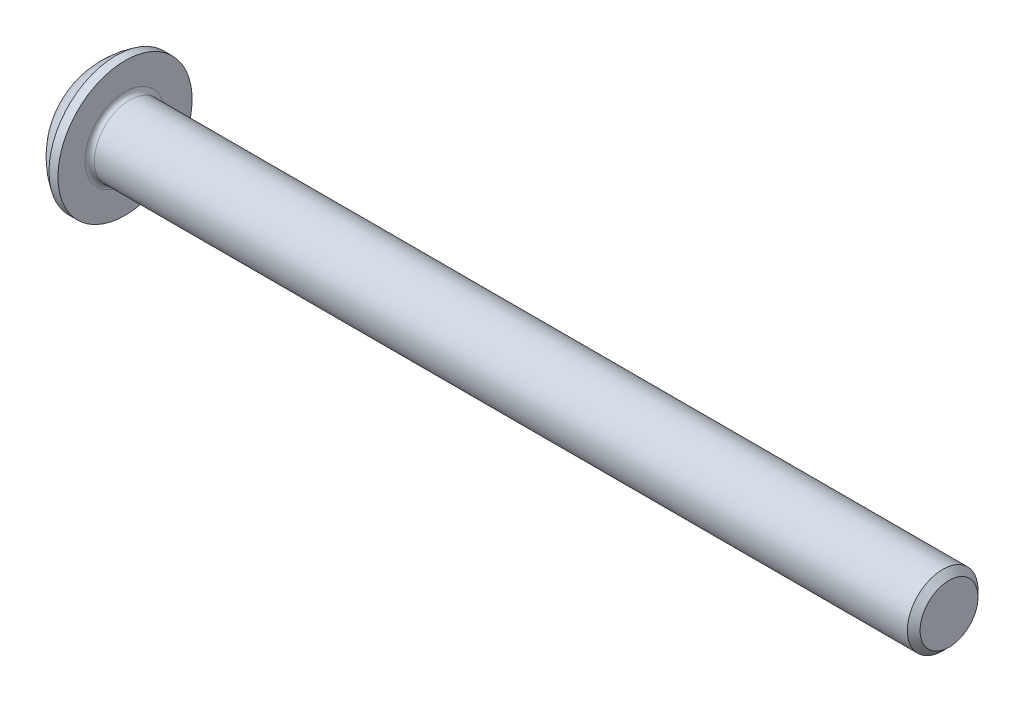
ISO-10303-21;
HEADER;
FILE_DESCRIPTION(('STEP AP214'),'2;1');
FILE_NAME('part.step','',(''),(''),'','','');
FILE_SCHEMA(('AUTOMOTIVE_DESIGN { 1 0 10303 214 1 1 1 1 }'));
ENDSEC;
DATA;
#1=APPLICATION_CONTEXT('core data for automotive mechanical design processes');
#2=APPLICATION_PROTOCOL_DEFINITION('international standard','automotive_design',2000,#1);
#3=PRODUCT_CONTEXT('',#1,'mechanical');
#4=PRODUCT('Part','Part','',(#3));
#5=PRODUCT_RELATED_PRODUCT_CATEGORY('part','',(#4));
#6=PRODUCT_DEFINITION_FORMATION('','',#4);
#7=PRODUCT_DEFINITION_CONTEXT('part definition',#1,'design');
#8=PRODUCT_DEFINITION('design','',#6,#7);
#9=PRODUCT_DEFINITION_SHAPE('','',#8);
#10=(LENGTH_UNIT() NAMED_UNIT(*) SI_UNIT(.MILLI.,.METRE.));
#11=(NAMED_UNIT(*) PLANE_ANGLE_UNIT() SI_UNIT($,.RADIAN.));
#12=(NAMED_UNIT(*) SI_UNIT($,.STERADIAN.) SOLID_ANGLE_UNIT());
#13=UNCERTAINTY_MEASURE_WITH_UNIT(LENGTH_MEASURE(1.E-05),#10,'distance_accuracy_value','');
#14=(GEOMETRIC_REPRESENTATION_CONTEXT(3) GLOBAL_UNCERTAINTY_ASSIGNED_CONTEXT((#13)) GLOBAL_UNIT_ASSIGNED_CONTEXT((#10,
#11,#12)) REPRESENTATION_CONTEXT('',''));
#15=CARTESIAN_POINT('',(0.,0.,0.));
#16=DIRECTION('',(0.,0.,1.));
#17=DIRECTION('',(1.,0.,0.));
#18=AXIS2_PLACEMENT_3D('',#15,#16,#17);
#19=CARTESIAN_POINT('',(0.,0.,0.));
#20=DIRECTION('',(-1.,0.,0.));
#21=DIRECTION('',(0.,0.,1.));
#22=AXIS2_PLACEMENT_3D('',#19,#20,#21);
#23=PLANE('',#22);
#24=CARTESIAN_POINT('',(0.,0.,0.));
#25=DIRECTION('',(-1.,0.,0.));
#26=DIRECTION('',(0.,0.,1.));
#27=AXIS2_PLACEMENT_3D('',#24,#25,#26);
#28=CIRCLE('',#27,1.425);
#29=CARTESIAN_POINT('',(0.,-1.42463005931565,0.0324683552754317));
#30=VERTEX_POINT('',#29);
#31=CARTESIAN_POINT('',(0.,-0.740433450145447,1.21753164472457));
#32=VERTEX_POINT('',#31);
#33=EDGE_CURVE('E201',#30,#32,#28,.T.);
#34=ORIENTED_EDGE('',*,*,#33,.T.);
#35=DIRECTION('',(0.,-0.5,-0.866025403784439));
#36=VECTOR('',#35,1.);
#37=CARTESIAN_POINT('',(0.,-1.44337567297406,0.));
#38=LINE('',#37,#36);
#39=EDGE_CURVE('E224',#32,#30,#38,.T.);
#40=ORIENTED_EDGE('',*,*,#39,.T.);
#41=EDGE_LOOP('',(#34,#40));
#42=FACE_BOUND('',#41,.T.);
#43=ADVANCED_FACE('F17',(#42),#23,.T.);
#44=CARTESIAN_POINT('',(0.,-0.740433450145447,-1.21753164472457));
#45=VERTEX_POINT('',#44);
#46=CARTESIAN_POINT('',(0.,-1.42463005931565,-0.0324683552754317));
#47=VERTEX_POINT('',#46);
#48=EDGE_CURVE('E215',#45,#47,#28,.T.);
#49=ORIENTED_EDGE('',*,*,#48,.T.);
#50=DIRECTION('',(0.,0.5,-0.866025403784439));
#51=VECTOR('',#50,1.);
#52=CARTESIAN_POINT('',(0.,-0.721687836487032,-1.25));
#53=LINE('',#52,#51);
#54=EDGE_CURVE('E267',#47,#45,#53,.T.);
#55=ORIENTED_EDGE('',*,*,#54,.T.);
#56=EDGE_LOOP('',(#49,#55));
#57=FACE_BOUND('',#56,.T.);
#58=ADVANCED_FACE('F309',(#57),#23,.T.);
#59=CARTESIAN_POINT('',(0.,0.684196609170199,-1.25));
#60=VERTEX_POINT('',#59);
#61=CARTESIAN_POINT('',(0.,-0.6841966091702,-1.25));
#62=VERTEX_POINT('',#61);
#63=EDGE_CURVE('E211',#60,#62,#28,.T.);
#64=ORIENTED_EDGE('',*,*,#63,.T.);
#65=DIRECTION('',(0.,1.,0.));
#66=VECTOR('',#65,1.);
#67=CARTESIAN_POINT('',(0.,0.721687836487033,-1.25));
#68=LINE('',#67,#66);
#69=EDGE_CURVE('E269',#62,#60,#68,.T.);
#70=ORIENTED_EDGE('',*,*,#69,.T.);
#71=EDGE_LOOP('',(#64,#70));
#72=FACE_BOUND('',#71,.T.);
#73=ADVANCED_FACE('F314',(#72),#23,.T.);
#74=CARTESIAN_POINT('',(0.,1.42463005931565,-0.0324683552754393));
#75=VERTEX_POINT('',#74);
#76=CARTESIAN_POINT('',(0.,0.740433450145451,-1.21753164472456));
#77=VERTEX_POINT('',#76);
#78=EDGE_CURVE('E207',#75,#77,#28,.T.);
#79=ORIENTED_EDGE('',*,*,#78,.T.);
#80=DIRECTION('',(0.,0.5,0.866025403784439));
#81=VECTOR('',#80,1.);
#82=CARTESIAN_POINT('',(0.,1.44337567297407,0.));
#83=LINE('',#82,#81);
#84=EDGE_CURVE('E271',#77,#75,#83,.T.);
#85=ORIENTED_EDGE('',*,*,#84,.T.);
#86=EDGE_LOOP('',(#79,#85));
#87=FACE_BOUND('',#86,.T.);
#88=ADVANCED_FACE('F325',(#87),#23,.T.);
#89=CARTESIAN_POINT('',(0.,0.740433450145451,1.21753164472456));
#90=VERTEX_POINT('',#89);
#91=CARTESIAN_POINT('',(0.,1.42463005931565,0.0324683552754395));
#92=VERTEX_POINT('',#91);
#93=EDGE_CURVE('E202',#90,#92,#28,.T.);
#94=ORIENTED_EDGE('',*,*,#93,.T.);
#95=DIRECTION('',(0.,-0.5,0.866025403784439));
#96=VECTOR('',#95,1.);
#97=CARTESIAN_POINT('',(0.,0.721687836487033,1.25));
#98=LINE('',#97,#96);
#99=EDGE_CURVE('E273',#92,#90,#98,.T.);
#100=ORIENTED_EDGE('',*,*,#99,.T.);
#101=EDGE_LOOP('',(#94,#100));
#102=FACE_BOUND('',#101,.T.);
#103=ADVANCED_FACE('F317',(#102),#23,.T.);
#104=CARTESIAN_POINT('',(0.,-0.6841966091702,1.25));
#105=VERTEX_POINT('',#104);
#106=CARTESIAN_POINT('',(0.,0.684196609170199,1.25));
#107=VERTEX_POINT('',#106);
#108=EDGE_CURVE('E199',#105,#107,#28,.T.);
#109=ORIENTED_EDGE('',*,*,#108,.T.);
#110=DIRECTION('',(0.,-1.,0.));
#111=VECTOR('',#110,1.);
#112=CARTESIAN_POINT('',(0.,-0.721687836487032,1.25));
#113=LINE('',#112,#111);
#114=EDGE_CURVE('E32',#107,#105,#113,.T.);
#115=ORIENTED_EDGE('',*,*,#114,.T.);
#116=EDGE_LOOP('',(#109,#115));
#117=FACE_BOUND('',#116,.T.);
#118=ADVANCED_FACE('F310',(#117),#23,.T.);
#119=CARTESIAN_POINT('',(3.03337598425197,0.,0.));
#120=DIRECTION('',(-1.,0.,0.));
#121=DIRECTION('',(0.,1.,0.));
#122=AXIS2_PLACEMENT_3D('',#119,#120,#121);
#123=SPHERICAL_SURFACE('',#122,3.35141684393879);
#124=CARTESIAN_POINT('',(1.27,0.,0.));
#125=DIRECTION('',(-1.,0.,0.));
#126=DIRECTION('',(0.,0.,1.));
#127=AXIS2_PLACEMENT_3D('',#124,#125,#126);
#128=CIRCLE('',#127,2.85);
#129=CARTESIAN_POINT('',(1.27,0.,2.85));
#130=VERTEX_POINT('',#129);
#131=EDGE_CURVE('E196',#130,#130,#128,.T.);
#132=ORIENTED_EDGE('',*,*,#131,.T.);
#133=EDGE_LOOP('',(#132));
#134=FACE_BOUND('',#133,.T.);
#135=ORIENTED_EDGE('',*,*,#33,.F.);
#136=CARTESIAN_POINT('',(3.03337598425197,-1.08253175473055,0.625));
#137=DIRECTION('',(0.,0.866025403784439,-0.5));
#138=DIRECTION('',(0.,0.5,0.866025403784439));
#139=AXIS2_PLACEMENT_3D('',#136,#137,#138);
#140=CIRCLE('',#139,3.10958113929137);
#141=CARTESIAN_POINT('',(0.00870054240646907,-1.44337567297406,0.));
#142=VERTEX_POINT('',#141);
#143=EDGE_CURVE('E179',#30,#142,#140,.F.);
#144=ORIENTED_EDGE('',*,*,#143,.T.);
#145=CARTESIAN_POINT('',(3.03337598425197,-1.08253175473055,-0.625));
#146=DIRECTION('',(0.,0.866025403784439,0.5));
#147=DIRECTION('',(0.,-0.5,0.866025403784439));
#148=AXIS2_PLACEMENT_3D('',#145,#146,#147);
#149=CIRCLE('',#148,3.10958113929137);
#150=EDGE_CURVE('E153',#142,#47,#149,.F.);
#151=ORIENTED_EDGE('',*,*,#150,.T.);
#152=ORIENTED_EDGE('',*,*,#48,.F.);
#153=CARTESIAN_POINT('',(0.00870054240646951,-0.721687836487032,-1.25));
#154=VERTEX_POINT('',#153);
#155=EDGE_CURVE('E176',#45,#154,#149,.F.);
#156=ORIENTED_EDGE('',*,*,#155,.T.);
#157=CARTESIAN_POINT('',(3.03337598425197,0.,-1.25));
#158=DIRECTION('',(0.,0.,1.));
#159=DIRECTION('',(1.,0.,0.));
#160=AXIS2_PLACEMENT_3D('',#157,#158,#159);
#161=CIRCLE('',#160,3.10958113929137);
#162=EDGE_CURVE('E175',#154,#62,#161,.F.);
#163=ORIENTED_EDGE('',*,*,#162,.T.);
#164=ORIENTED_EDGE('',*,*,#63,.F.);
#165=CARTESIAN_POINT('',(0.00870054240647037,0.721687836487034,-1.25));
#166=VERTEX_POINT('',#165);
#167=EDGE_CURVE('E172',#60,#166,#161,.F.);
#168=ORIENTED_EDGE('',*,*,#167,.T.);
#169=CARTESIAN_POINT('',(3.03337598425197,1.08253175473055,-0.625));
#170=DIRECTION('',(0.,-0.866025403784439,0.5));
#171=DIRECTION('',(0.,-0.5,-0.866025403784439));
#172=AXIS2_PLACEMENT_3D('',#169,#170,#171);
#173=CIRCLE('',#172,3.10958113929137);
#174=EDGE_CURVE('E171',#166,#77,#173,.F.);
#175=ORIENTED_EDGE('',*,*,#174,.T.);
#176=ORIENTED_EDGE('',*,*,#78,.F.);
#177=CARTESIAN_POINT('',(0.00870054240647081,1.44337567297407,0.));
#178=VERTEX_POINT('',#177);
#179=EDGE_CURVE('E168',#75,#178,#173,.F.);
#180=ORIENTED_EDGE('',*,*,#179,.T.);
#181=CARTESIAN_POINT('',(3.03337598425197,1.08253175473055,0.625));
#182=DIRECTION('',(0.,-0.866025403784438,-0.5));
#183=DIRECTION('',(0.,0.5,-0.866025403784438));
#184=AXIS2_PLACEMENT_3D('',#181,#182,#183);
#185=CIRCLE('',#184,3.10958113929137);
#186=EDGE_CURVE('E167',#178,#92,#185,.F.);
#187=ORIENTED_EDGE('',*,*,#186,.T.);
#188=ORIENTED_EDGE('',*,*,#93,.F.);
#189=CARTESIAN_POINT('',(0.00870054240646994,0.721687836487033,1.25));
#190=VERTEX_POINT('',#189);
#191=EDGE_CURVE('E164',#90,#190,#185,.F.);
#192=ORIENTED_EDGE('',*,*,#191,.T.);
#193=CARTESIAN_POINT('',(3.03337598425197,0.,1.25));
#194=DIRECTION('',(0.,0.,-1.));
#195=DIRECTION('',(-1.,0.,0.));
#196=AXIS2_PLACEMENT_3D('',#193,#194,#195);
#197=CIRCLE('',#196,3.10958113929137);
#198=EDGE_CURVE('E154',#190,#107,#197,.F.);
#199=ORIENTED_EDGE('',*,*,#198,.T.);
#200=ORIENTED_EDGE('',*,*,#108,.F.);
#201=CARTESIAN_POINT('',(0.00870054240646951,-0.721687836487032,1.25));
#202=VERTEX_POINT('',#201);
#203=EDGE_CURVE('E157',#105,#202,#197,.F.);
#204=ORIENTED_EDGE('',*,*,#203,.T.);
#205=EDGE_CURVE('E181',#202,#32,#140,.F.);
#206=ORIENTED_EDGE('',*,*,#205,.T.);
#207=EDGE_LOOP('',(#135,#144,#151,#152,#156,#163,#164,#168,#175,#176,#180,#187,#188,#192,#199,
#200,#204,#206));
#208=FACE_BOUND('',#207,.T.);
#209=ADVANCED_FACE('F227',(#134,#208),#123,.T.);
#210=CARTESIAN_POINT('',(0.,0.,0.));
#211=DIRECTION('',(-1.,0.,0.));
#212=DIRECTION('',(0.,0.,1.));
#213=AXIS2_PLACEMENT_3D('',#210,#211,#212);
#214=CYLINDRICAL_SURFACE('',#213,2.85);
#215=ORIENTED_EDGE('',*,*,#131,.F.);
#216=EDGE_LOOP('',(#215));
#217=FACE_BOUND('',#216,.T.);
#218=CARTESIAN_POINT('',(1.65,0.,0.));
#219=DIRECTION('',(-1.,0.,0.));
#220=DIRECTION('',(0.,0.,1.));
#221=AXIS2_PLACEMENT_3D('',#218,#219,#220);
#222=CIRCLE('',#221,2.85);
#223=CARTESIAN_POINT('',(1.65,0.,2.85));
#224=VERTEX_POINT('',#223);
#225=EDGE_CURVE('E193',#224,#224,#222,.T.);
#226=ORIENTED_EDGE('',*,*,#225,.T.);
#227=EDGE_LOOP('',(#226));
#228=FACE_BOUND('',#227,.T.);
#229=ADVANCED_FACE('F323',(#217,#228),#214,.T.);
#230=CARTESIAN_POINT('',(1.65,1.5,0.));
#231=DIRECTION('',(-1.,0.,0.));
#232=DIRECTION('',(0.,0.,1.));
#233=AXIS2_PLACEMENT_3D('',#230,#231,#232);
#234=PLANE('',#233);
#235=CARTESIAN_POINT('',(1.65,0.,0.));
#236=DIRECTION('',(-1.,0.,0.));
#237=DIRECTION('',(0.,0.,1.));
#238=AXIS2_PLACEMENT_3D('',#235,#236,#237);
#239=CIRCLE('',#238,1.7);
#240=CARTESIAN_POINT('',(1.65,0.,1.7));
#241=VERTEX_POINT('',#240);
#242=EDGE_CURVE('E25',#241,#241,#239,.T.);
#243=ORIENTED_EDGE('',*,*,#242,.T.);
#244=EDGE_LOOP('',(#243));
#245=FACE_BOUND('',#244,.T.);
#246=ORIENTED_EDGE('',*,*,#225,.F.);
#247=EDGE_LOOP('',(#246));
#248=FACE_BOUND('',#247,.T.);
#249=ADVANCED_FACE('F430',(#245,#248),#234,.F.);
#250=CARTESIAN_POINT('',(0.,0.,0.));
#251=DIRECTION('',(-1.,0.,0.));
#252=DIRECTION('',(0.,0.,1.));
#253=AXIS2_PLACEMENT_3D('',#250,#251,#252);
#254=CYLINDRICAL_SURFACE('',#253,1.5);
#255=CARTESIAN_POINT('',(1.85,0.,0.));
#256=DIRECTION('',(-1.,0.,0.));
#257=DIRECTION('',(0.,0.,1.));
#258=AXIS2_PLACEMENT_3D('',#255,#256,#257);
#259=CIRCLE('',#258,1.5);
#260=CARTESIAN_POINT('',(1.85,0.,1.5));
#261=VERTEX_POINT('',#260);
#262=EDGE_CURVE('E11',#261,#261,#259,.F.);
#263=ORIENTED_EDGE('',*,*,#262,.T.);
#264=EDGE_LOOP('',(#263));
#265=FACE_BOUND('',#264,.T.);
#266=CARTESIAN_POINT('',(36.38,0.,0.));
#267=DIRECTION('',(-1.,0.,0.));
#268=DIRECTION('',(0.,0.,1.));
#269=AXIS2_PLACEMENT_3D('',#266,#267,#268);
#270=CIRCLE('',#269,1.5);
#271=CARTESIAN_POINT('',(36.38,0.,1.5));
#272=VERTEX_POINT('',#271);
#273=EDGE_CURVE('E190',#272,#272,#270,.T.);
#274=ORIENTED_EDGE('',*,*,#273,.T.);
#275=EDGE_LOOP('',(#274));
#276=FACE_BOUND('',#275,.T.);
#277=ADVANCED_FACE('F420',(#265,#276),#254,.T.);
#278=CARTESIAN_POINT('',(36.65,0.,0.));
#279=DIRECTION('',(-1.,0.,0.));
#280=DIRECTION('',(0.,0.,1.));
#281=AXIS2_PLACEMENT_3D('',#278,#279,#280);
#282=CONICAL_SURFACE('',#281,1.23,0.785398163397416);
#283=ORIENTED_EDGE('',*,*,#273,.F.);
#284=EDGE_LOOP('',(#283));
#285=FACE_BOUND('',#284,.T.);
#286=CARTESIAN_POINT('',(36.65,0.,0.));
#287=DIRECTION('',(-1.,0.,0.));
#288=DIRECTION('',(0.,0.,1.));
#289=AXIS2_PLACEMENT_3D('',#286,#287,#288);
#290=CIRCLE('',#289,1.23);
#291=CARTESIAN_POINT('',(36.65,0.,1.23));
#292=VERTEX_POINT('',#291);
#293=EDGE_CURVE('E185',#292,#292,#290,.T.);
#294=ORIENTED_EDGE('',*,*,#293,.T.);
#295=EDGE_LOOP('',(#294));
#296=FACE_BOUND('',#295,.T.);
#297=ADVANCED_FACE('F411',(#285,#296),#282,.T.);
#298=CARTESIAN_POINT('',(36.65,0.,0.));
#299=DIRECTION('',(-1.,0.,0.));
#300=DIRECTION('',(0.,0.,1.));
#301=AXIS2_PLACEMENT_3D('',#298,#299,#300);
#302=PLANE('',#301);
#303=ORIENTED_EDGE('',*,*,#293,.F.);
#304=EDGE_LOOP('',(#303));
#305=FACE_BOUND('',#304,.T.);
#306=ADVANCED_FACE('F402',(#305),#302,.F.);
#307=CARTESIAN_POINT('',(1.85,0.,0.));
#308=DIRECTION('',(-1.,0.,0.));
#309=DIRECTION('',(0.,0.,1.));
#310=AXIS2_PLACEMENT_3D('',#307,#308,#309);
#311=TOROIDAL_SURFACE('',#310,1.7,0.2);
#312=ORIENTED_EDGE('',*,*,#262,.F.);
#313=EDGE_LOOP('',(#312));
#314=FACE_BOUND('',#313,.T.);
#315=ORIENTED_EDGE('',*,*,#242,.F.);
#316=EDGE_LOOP('',(#315));
#317=FACE_BOUND('',#316,.T.);
#318=ADVANCED_FACE('F19',(#314,#317),#311,.F.);
#319=CARTESIAN_POINT('',(1.3,-1.44337567297406,0.));
#320=DIRECTION('',(0.,0.866025403784439,-0.5));
#321=DIRECTION('',(0.,0.5,0.866025403784439));
#322=AXIS2_PLACEMENT_3D('',#319,#320,#321);
#323=PLANE('',#322);
#324=DIRECTION('',(-1.,0.,0.));
#325=VECTOR('',#324,1.);
#326=CARTESIAN_POINT('',(1.3,-0.721687836487032,1.25));
#327=LINE('',#326,#325);
#328=CARTESIAN_POINT('',(1.3,-0.721687836487032,1.25));
#329=VERTEX_POINT('',#328);
#330=EDGE_CURVE('E265',#329,#202,#327,.T.);
#331=ORIENTED_EDGE('',*,*,#330,.F.);
#332=DIRECTION('',(0.,-0.5,-0.866025403784439));
#333=VECTOR('',#332,1.);
#334=CARTESIAN_POINT('',(1.3,-1.44337567297406,0.));
#335=LINE('',#334,#333);
#336=CARTESIAN_POINT('',(1.3,-1.08253175473055,0.625));
#337=VERTEX_POINT('',#336);
#338=EDGE_CURVE('E137',#329,#337,#335,.T.);
#339=ORIENTED_EDGE('',*,*,#338,.T.);
#340=CARTESIAN_POINT('',(1.3,-1.44337567297406,0.));
#341=VERTEX_POINT('',#340);
#342=EDGE_CURVE('E128',#337,#341,#335,.T.);
#343=ORIENTED_EDGE('',*,*,#342,.T.);
#344=DIRECTION('',(-1.,0.,0.));
#345=VECTOR('',#344,1.);
#346=CARTESIAN_POINT('',(1.3,-1.44337567297406,0.));
#347=LINE('',#346,#345);
#348=EDGE_CURVE('E134',#341,#142,#347,.T.);
#349=ORIENTED_EDGE('',*,*,#348,.T.);
#350=ORIENTED_EDGE('',*,*,#143,.F.);
#351=ORIENTED_EDGE('',*,*,#39,.F.);
#352=ORIENTED_EDGE('',*,*,#205,.F.);
#353=EDGE_LOOP('',(#331,#339,#343,#349,#350,#351,#352));
#354=FACE_BOUND('',#353,.T.);
#355=ADVANCED_FACE('F131',(#354),#323,.T.);
#356=CARTESIAN_POINT('',(1.3,-0.721687836487032,-1.25));
#357=DIRECTION('',(0.,0.866025403784439,0.5));
#358=DIRECTION('',(0.,-0.5,0.866025403784439));
#359=AXIS2_PLACEMENT_3D('',#356,#357,#358);
#360=PLANE('',#359);
#361=ORIENTED_EDGE('',*,*,#348,.F.);
#362=DIRECTION('',(0.,0.5,-0.866025403784439));
#363=VECTOR('',#362,1.);
#364=CARTESIAN_POINT('',(1.3,-0.721687836487032,-1.25));
#365=LINE('',#364,#363);
#366=CARTESIAN_POINT('',(1.3,-1.08253175473055,-0.625));
#367=VERTEX_POINT('',#366);
#368=EDGE_CURVE('E142',#341,#367,#365,.T.);
#369=ORIENTED_EDGE('',*,*,#368,.T.);
#370=CARTESIAN_POINT('',(1.3,-0.721687836487032,-1.25));
#371=VERTEX_POINT('',#370);
#372=EDGE_CURVE('E149',#367,#371,#365,.T.);
#373=ORIENTED_EDGE('',*,*,#372,.T.);
#374=DIRECTION('',(-1.,0.,0.));
#375=VECTOR('',#374,1.);
#376=CARTESIAN_POINT('',(1.3,-0.721687836487032,-1.25));
#377=LINE('',#376,#375);
#378=EDGE_CURVE('E155',#371,#154,#377,.T.);
#379=ORIENTED_EDGE('',*,*,#378,.T.);
#380=ORIENTED_EDGE('',*,*,#155,.F.);
#381=ORIENTED_EDGE('',*,*,#54,.F.);
#382=ORIENTED_EDGE('',*,*,#150,.F.);
#383=EDGE_LOOP('',(#361,#369,#373,#379,#380,#381,#382));
#384=FACE_BOUND('',#383,.T.);
#385=ADVANCED_FACE('F151',(#384),#360,.T.);
#386=CARTESIAN_POINT('',(1.3,0.721687836487033,-1.25));
#387=DIRECTION('',(0.,0.,1.));
#388=DIRECTION('',(1.,0.,0.));
#389=AXIS2_PLACEMENT_3D('',#386,#387,#388);
#390=PLANE('',#389);
#391=ORIENTED_EDGE('',*,*,#378,.F.);
#392=DIRECTION('',(0.,1.,0.));
#393=VECTOR('',#392,1.);
#394=CARTESIAN_POINT('',(1.3,0.721687836487033,-1.25));
#395=LINE('',#394,#393);
#396=CARTESIAN_POINT('',(1.3,0.,-1.25));
#397=VERTEX_POINT('',#396);
#398=EDGE_CURVE('E294',#371,#397,#395,.T.);
#399=ORIENTED_EDGE('',*,*,#398,.T.);
#400=CARTESIAN_POINT('',(1.3,0.721687836487033,-1.25));
#401=VERTEX_POINT('',#400);
#402=EDGE_CURVE('E148',#397,#401,#395,.T.);
#403=ORIENTED_EDGE('',*,*,#402,.T.);
#404=DIRECTION('',(-1.,0.,0.));
#405=VECTOR('',#404,1.);
#406=CARTESIAN_POINT('',(1.3,0.721687836487033,-1.25));
#407=LINE('',#406,#405);
#408=EDGE_CURVE('E160',#401,#166,#407,.T.);
#409=ORIENTED_EDGE('',*,*,#408,.T.);
#410=ORIENTED_EDGE('',*,*,#167,.F.);
#411=ORIENTED_EDGE('',*,*,#69,.F.);
#412=ORIENTED_EDGE('',*,*,#162,.F.);
#413=EDGE_LOOP('',(#391,#399,#403,#409,#410,#411,#412));
#414=FACE_BOUND('',#413,.T.);
#415=ADVANCED_FACE('F284',(#414),#390,.T.);
#416=CARTESIAN_POINT('',(1.3,1.44337567297407,0.));
#417=DIRECTION('',(0.,-0.866025403784439,0.5));
#418=DIRECTION('',(0.,-0.5,-0.866025403784439));
#419=AXIS2_PLACEMENT_3D('',#416,#417,#418);
#420=PLANE('',#419);
#421=ORIENTED_EDGE('',*,*,#408,.F.);
#422=DIRECTION('',(0.,0.5,0.866025403784439));
#423=VECTOR('',#422,1.);
#424=CARTESIAN_POINT('',(1.3,1.44337567297407,0.));
#425=LINE('',#424,#423);
#426=CARTESIAN_POINT('',(1.3,1.08253175473055,-0.625));
#427=VERTEX_POINT('',#426);
#428=EDGE_CURVE('E254',#401,#427,#425,.T.);
#429=ORIENTED_EDGE('',*,*,#428,.T.);
#430=CARTESIAN_POINT('',(1.3,1.44337567297407,0.));
#431=VERTEX_POINT('',#430);
#432=EDGE_CURVE('E247',#427,#431,#425,.T.);
#433=ORIENTED_EDGE('',*,*,#432,.T.);
#434=DIRECTION('',(-1.,0.,0.));
#435=VECTOR('',#434,1.);
#436=CARTESIAN_POINT('',(1.3,1.44337567297407,0.));
#437=LINE('',#436,#435);
#438=EDGE_CURVE('E259',#431,#178,#437,.T.);
#439=ORIENTED_EDGE('',*,*,#438,.T.);
#440=ORIENTED_EDGE('',*,*,#179,.F.);
#441=ORIENTED_EDGE('',*,*,#84,.F.);
#442=ORIENTED_EDGE('',*,*,#174,.F.);
#443=EDGE_LOOP('',(#421,#429,#433,#439,#440,#441,#442));
#444=FACE_BOUND('',#443,.T.);
#445=ADVANCED_FACE('F295',(#444),#420,.T.);
#446=CARTESIAN_POINT('',(1.3,0.721687836487033,1.25));
#447=DIRECTION('',(0.,-0.866025403784438,-0.5));
#448=DIRECTION('',(0.,0.5,-0.866025403784438));
#449=AXIS2_PLACEMENT_3D('',#446,#447,#448);
#450=PLANE('',#449);
#451=ORIENTED_EDGE('',*,*,#438,.F.);
#452=DIRECTION('',(0.,-0.5,0.866025403784439));
#453=VECTOR('',#452,1.);
#454=CARTESIAN_POINT('',(1.3,0.721687836487033,1.25));
#455=LINE('',#454,#453);
#456=CARTESIAN_POINT('',(1.3,1.08253175473055,0.625));
#457=VERTEX_POINT('',#456);
#458=EDGE_CURVE('E246',#431,#457,#455,.T.);
#459=ORIENTED_EDGE('',*,*,#458,.T.);
#460=CARTESIAN_POINT('',(1.3,0.721687836487033,1.25));
#461=VERTEX_POINT('',#460);
#462=EDGE_CURVE('E250',#457,#461,#455,.T.);
#463=ORIENTED_EDGE('',*,*,#462,.T.);
#464=DIRECTION('',(-1.,0.,0.));
#465=VECTOR('',#464,1.);
#466=CARTESIAN_POINT('',(1.3,0.721687836487033,1.25));
#467=LINE('',#466,#465);
#468=EDGE_CURVE('E277',#461,#190,#467,.T.);
#469=ORIENTED_EDGE('',*,*,#468,.T.);
#470=ORIENTED_EDGE('',*,*,#191,.F.);
#471=ORIENTED_EDGE('',*,*,#99,.F.);
#472=ORIENTED_EDGE('',*,*,#186,.F.);
#473=EDGE_LOOP('',(#451,#459,#463,#469,#470,#471,#472));
#474=FACE_BOUND('',#473,.T.);
#475=ADVANCED_FACE('F257',(#474),#450,.T.);
#476=CARTESIAN_POINT('',(1.3,-0.721687836487032,1.25));
#477=DIRECTION('',(0.,0.,-1.));
#478=DIRECTION('',(-1.,0.,0.));
#479=AXIS2_PLACEMENT_3D('',#476,#477,#478);
#480=PLANE('',#479);
#481=ORIENTED_EDGE('',*,*,#468,.F.);
#482=DIRECTION('',(0.,-1.,0.));
#483=VECTOR('',#482,1.);
#484=CARTESIAN_POINT('',(1.3,-0.721687836487032,1.25));
#485=LINE('',#484,#483);
#486=CARTESIAN_POINT('',(1.3,0.,1.25));
#487=VERTEX_POINT('',#486);
#488=EDGE_CURVE('E39',#461,#487,#485,.T.);
#489=ORIENTED_EDGE('',*,*,#488,.T.);
#490=EDGE_CURVE('E260',#487,#329,#485,.T.);
#491=ORIENTED_EDGE('',*,*,#490,.T.);
#492=ORIENTED_EDGE('',*,*,#330,.T.);
#493=ORIENTED_EDGE('',*,*,#203,.F.);
#494=ORIENTED_EDGE('',*,*,#114,.F.);
#495=ORIENTED_EDGE('',*,*,#198,.F.);
#496=EDGE_LOOP('',(#481,#489,#491,#492,#493,#494,#495));
#497=FACE_BOUND('',#496,.T.);
#498=ADVANCED_FACE('F327',(#497),#480,.T.);
#499=CARTESIAN_POINT('',(1.3,0.,2.5));
#500=DIRECTION('',(-1.,0.,0.));
#501=DIRECTION('',(0.,0.,1.));
#502=AXIS2_PLACEMENT_3D('',#499,#500,#501);
#503=PLANE('',#502);
#504=ORIENTED_EDGE('',*,*,#488,.F.);
#505=ORIENTED_EDGE('',*,*,#462,.F.);
#506=CARTESIAN_POINT('',(1.3,0.,0.));
#507=DIRECTION('',(-1.,0.,0.));
#508=DIRECTION('',(0.,0.,1.));
#509=AXIS2_PLACEMENT_3D('',#506,#507,#508);
#510=CIRCLE('',#509,1.25);
#511=EDGE_CURVE('E182',#487,#457,#510,.T.);
#512=ORIENTED_EDGE('',*,*,#511,.F.);
#513=EDGE_LOOP('',(#504,#505,#512));
#514=FACE_BOUND('',#513,.T.);
#515=ADVANCED_FACE('F251',(#514),#503,.T.);
#516=ORIENTED_EDGE('',*,*,#458,.F.);
#517=ORIENTED_EDGE('',*,*,#432,.F.);
#518=EDGE_CURVE('E186',#457,#427,#510,.T.);
#519=ORIENTED_EDGE('',*,*,#518,.F.);
#520=EDGE_LOOP('',(#516,#517,#519));
#521=FACE_BOUND('',#520,.T.);
#522=ADVANCED_FACE('F244',(#521),#503,.T.);
#523=ORIENTED_EDGE('',*,*,#428,.F.);
#524=ORIENTED_EDGE('',*,*,#402,.F.);
#525=EDGE_CURVE('E234',#427,#397,#510,.T.);
#526=ORIENTED_EDGE('',*,*,#525,.F.);
#527=EDGE_LOOP('',(#523,#524,#526));
#528=FACE_BOUND('',#527,.T.);
#529=ADVANCED_FACE('F297',(#528),#503,.T.);
#530=ORIENTED_EDGE('',*,*,#398,.F.);
#531=ORIENTED_EDGE('',*,*,#372,.F.);
#532=EDGE_CURVE('E233',#397,#367,#510,.T.);
#533=ORIENTED_EDGE('',*,*,#532,.F.);
#534=EDGE_LOOP('',(#530,#531,#533));
#535=FACE_BOUND('',#534,.T.);
#536=ADVANCED_FACE('F299',(#535),#503,.T.);
#537=ORIENTED_EDGE('',*,*,#368,.F.);
#538=ORIENTED_EDGE('',*,*,#342,.F.);
#539=EDGE_CURVE('E144',#367,#337,#510,.T.);
#540=ORIENTED_EDGE('',*,*,#539,.F.);
#541=EDGE_LOOP('',(#537,#538,#540));
#542=FACE_BOUND('',#541,.T.);
#543=ADVANCED_FACE('F143',(#542),#503,.T.);
#544=ORIENTED_EDGE('',*,*,#338,.F.);
#545=ORIENTED_EDGE('',*,*,#490,.F.);
#546=EDGE_CURVE('E187',#337,#487,#510,.T.);
#547=ORIENTED_EDGE('',*,*,#546,.F.);
#548=EDGE_LOOP('',(#544,#545,#547));
#549=FACE_BOUND('',#548,.T.);
#550=ADVANCED_FACE('F306',(#549),#503,.T.);
#551=CARTESIAN_POINT('',(2.02168783648704,0.,0.));
#552=DIRECTION('',(-1.,0.,0.));
#553=DIRECTION('',(0.,0.,1.));
#554=AXIS2_PLACEMENT_3D('',#551,#552,#553);
#555=CONICAL_SURFACE('',#554,0.,1.0471975511966);
#556=ORIENTED_EDGE('',*,*,#511,.T.);
#557=ORIENTED_EDGE('',*,*,#518,.T.);
#558=ORIENTED_EDGE('',*,*,#525,.T.);
#559=ORIENTED_EDGE('',*,*,#532,.T.);
#560=ORIENTED_EDGE('',*,*,#539,.T.);
#561=ORIENTED_EDGE('',*,*,#546,.T.);
#562=EDGE_LOOP('',(#556,#557,#558,#559,#560,#561));
#563=FACE_BOUND('',#562,.T.);
#564=CARTESIAN_POINT('',(2.02168783648704,0.,0.));
#565=VERTEX_POINT('',#564);
#566=VERTEX_LOOP('',#565);
#567=FACE_BOUND('',#566,.T.);
#568=ADVANCED_FACE('F237',(#563,#567),#555,.F.);
#569=CLOSED_SHELL('',(#43,#58,#73,#88,#103,#118,#209,#229,#249,#277,#297,#306,#318,#355,#385,
#415,#445,#475,#498,#515,#522,#529,#536,#543,#550,#568));
#570=MANIFOLD_SOLID_BREP('B1',#569);
#571=ADVANCED_BREP_SHAPE_REPRESENTATION('',(#18,#570),#14);
#572=SHAPE_DEFINITION_REPRESENTATION(#9,#571);
ENDSEC;
END-ISO-10303-21;
